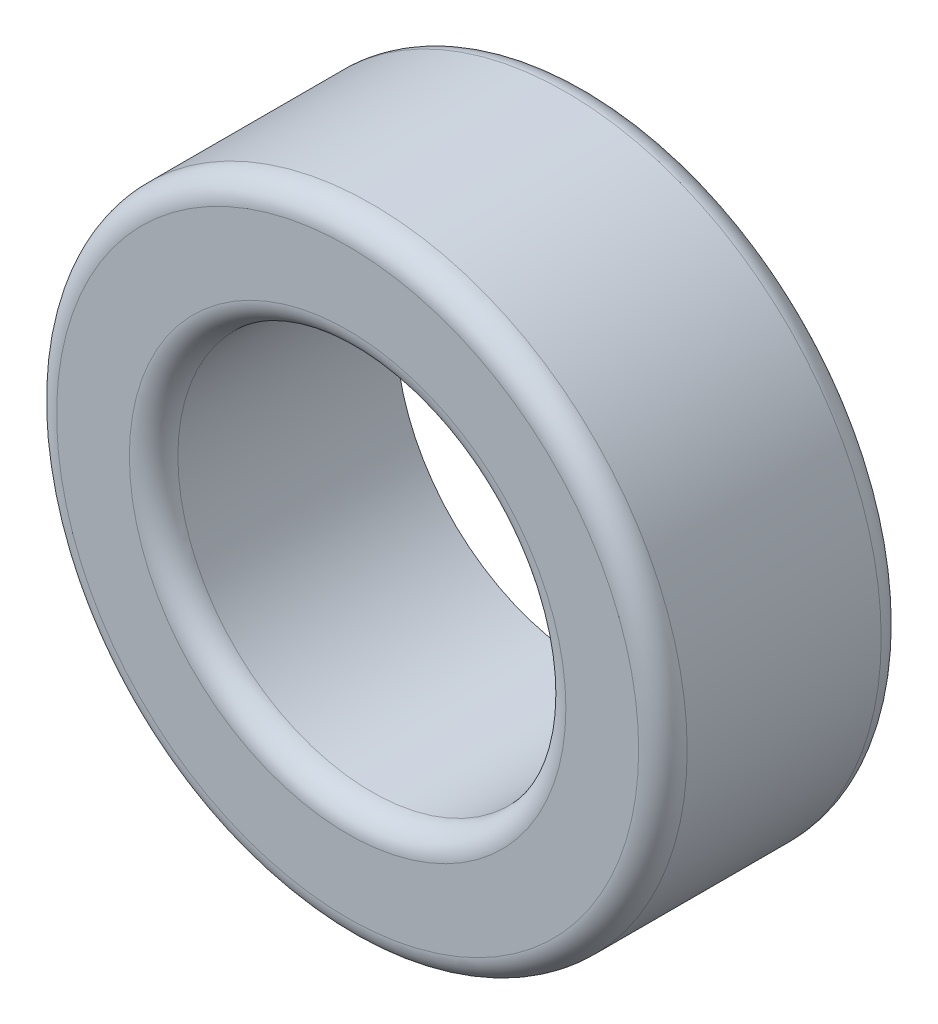
ISO-10303-21;
HEADER;
FILE_DESCRIPTION(('STEP AP214'),'2;1');
FILE_NAME('part.step','',(''),(''),'','','');
FILE_SCHEMA(('AUTOMOTIVE_DESIGN { 1 0 10303 214 1 1 1 1 }'));
ENDSEC;
DATA;
#1=APPLICATION_CONTEXT('core data for automotive mechanical design processes');
#2=APPLICATION_PROTOCOL_DEFINITION('international standard','automotive_design',2000,#1);
#3=PRODUCT_CONTEXT('',#1,'mechanical');
#4=PRODUCT('Part','Part','',(#3));
#5=PRODUCT_RELATED_PRODUCT_CATEGORY('part','',(#4));
#6=PRODUCT_DEFINITION_FORMATION('','',#4);
#7=PRODUCT_DEFINITION_CONTEXT('part definition',#1,'design');
#8=PRODUCT_DEFINITION('design','',#6,#7);
#9=PRODUCT_DEFINITION_SHAPE('','',#8);
#10=(LENGTH_UNIT() NAMED_UNIT(*) SI_UNIT(.MILLI.,.METRE.));
#11=(NAMED_UNIT(*) PLANE_ANGLE_UNIT() SI_UNIT($,.RADIAN.));
#12=(NAMED_UNIT(*) SI_UNIT($,.STERADIAN.) SOLID_ANGLE_UNIT());
#13=UNCERTAINTY_MEASURE_WITH_UNIT(LENGTH_MEASURE(1.E-05),#10,'distance_accuracy_value','');
#14=(GEOMETRIC_REPRESENTATION_CONTEXT(3) GLOBAL_UNCERTAINTY_ASSIGNED_CONTEXT((#13)) GLOBAL_UNIT_ASSIGNED_CONTEXT((#10,
#11,#12)) REPRESENTATION_CONTEXT('',''));
#15=CARTESIAN_POINT('',(0.,0.,0.));
#16=DIRECTION('',(0.,0.,1.));
#17=DIRECTION('',(1.,0.,0.));
#18=AXIS2_PLACEMENT_3D('',#15,#16,#17);
#19=CARTESIAN_POINT('',(0.,0.,5.));
#20=DIRECTION('',(0.,0.,1.));
#21=DIRECTION('',(1.,0.,0.));
#22=AXIS2_PLACEMENT_3D('',#19,#20,#21);
#23=PLANE('',#22);
#24=CARTESIAN_POINT('',(0.,0.,5.));
#25=DIRECTION('',(0.,0.,1.));
#26=DIRECTION('',(1.,0.,0.));
#27=AXIS2_PLACEMENT_3D('',#24,#25,#26);
#28=CIRCLE('',#27,4.5);
#29=CARTESIAN_POINT('',(4.5,0.,5.));
#30=VERTEX_POINT('',#29);
#31=EDGE_CURVE('E56',#30,#30,#28,.F.);
#32=ORIENTED_EDGE('',*,*,#31,.T.);
#33=EDGE_LOOP('',(#32));
#34=FACE_BOUND('',#33,.T.);
#35=CARTESIAN_POINT('',(0.,0.,5.));
#36=DIRECTION('',(0.,0.,1.));
#37=DIRECTION('',(1.,0.,0.));
#38=AXIS2_PLACEMENT_3D('',#35,#36,#37);
#39=CIRCLE('',#38,6.);
#40=CARTESIAN_POINT('',(6.,0.,5.));
#41=VERTEX_POINT('',#40);
#42=EDGE_CURVE('E62',#41,#41,#39,.T.);
#43=ORIENTED_EDGE('',*,*,#42,.T.);
#44=EDGE_LOOP('',(#43));
#45=FACE_BOUND('',#44,.T.);
#46=ADVANCED_FACE('F38',(#34,#45),#23,.T.);
#47=CARTESIAN_POINT('',(0.,0.,0.));
#48=DIRECTION('',(0.,0.,1.));
#49=DIRECTION('',(1.,0.,0.));
#50=AXIS2_PLACEMENT_3D('',#47,#48,#49);
#51=PLANE('',#50);
#52=CARTESIAN_POINT('',(0.,0.,0.));
#53=DIRECTION('',(0.,0.,1.));
#54=DIRECTION('',(1.,0.,0.));
#55=AXIS2_PLACEMENT_3D('',#52,#53,#54);
#56=CIRCLE('',#55,6.);
#57=CARTESIAN_POINT('',(6.,0.,0.));
#58=VERTEX_POINT('',#57);
#59=EDGE_CURVE('E10',#58,#58,#56,.F.);
#60=ORIENTED_EDGE('',*,*,#59,.T.);
#61=EDGE_LOOP('',(#60));
#62=FACE_BOUND('',#61,.T.);
#63=CARTESIAN_POINT('',(0.,0.,0.));
#64=DIRECTION('',(0.,0.,1.));
#65=DIRECTION('',(1.,0.,0.));
#66=AXIS2_PLACEMENT_3D('',#63,#64,#65);
#67=CIRCLE('',#66,4.);
#68=CARTESIAN_POINT('',(4.,0.,0.));
#69=VERTEX_POINT('',#68);
#70=EDGE_CURVE('E70',#69,#69,#67,.T.);
#71=ORIENTED_EDGE('',*,*,#70,.T.);
#72=EDGE_LOOP('',(#71));
#73=FACE_BOUND('',#72,.T.);
#74=ADVANCED_FACE('F75',(#62,#73),#51,.F.);
#75=CARTESIAN_POINT('',(0.,0.,5.));
#76=DIRECTION('',(0.,0.,-1.));
#77=DIRECTION('',(-1.,0.,0.));
#78=AXIS2_PLACEMENT_3D('',#75,#76,#77);
#79=CYLINDRICAL_SURFACE('',#78,6.5);
#80=CARTESIAN_POINT('',(0.,0.,4.5));
#81=DIRECTION('',(0.,0.,1.));
#82=DIRECTION('',(1.,0.,0.));
#83=AXIS2_PLACEMENT_3D('',#80,#81,#82);
#84=CIRCLE('',#83,6.5);
#85=CARTESIAN_POINT('',(6.5,0.,4.5));
#86=VERTEX_POINT('',#85);
#87=EDGE_CURVE('E46',#86,#86,#84,.F.);
#88=ORIENTED_EDGE('',*,*,#87,.T.);
#89=EDGE_LOOP('',(#88));
#90=FACE_BOUND('',#89,.T.);
#91=CARTESIAN_POINT('',(0.,0.,0.5));
#92=DIRECTION('',(0.,0.,1.));
#93=DIRECTION('',(1.,0.,0.));
#94=AXIS2_PLACEMENT_3D('',#91,#92,#93);
#95=CIRCLE('',#94,6.5);
#96=CARTESIAN_POINT('',(6.5,0.,0.5));
#97=VERTEX_POINT('',#96);
#98=EDGE_CURVE('E51',#97,#97,#95,.T.);
#99=ORIENTED_EDGE('',*,*,#98,.T.);
#100=EDGE_LOOP('',(#99));
#101=FACE_BOUND('',#100,.T.);
#102=ADVANCED_FACE('F80',(#90,#101),#79,.T.);
#103=CARTESIAN_POINT('',(0.,0.,5.));
#104=DIRECTION('',(0.,0.,-1.));
#105=DIRECTION('',(-1.,0.,0.));
#106=AXIS2_PLACEMENT_3D('',#103,#104,#105);
#107=CYLINDRICAL_SURFACE('',#106,4.);
#108=CARTESIAN_POINT('',(0.,0.,4.5));
#109=DIRECTION('',(0.,0.,1.));
#110=DIRECTION('',(1.,0.,0.));
#111=AXIS2_PLACEMENT_3D('',#108,#109,#110);
#112=CIRCLE('',#111,4.);
#113=CARTESIAN_POINT('',(4.,0.,4.5));
#114=VERTEX_POINT('',#113);
#115=EDGE_CURVE('E66',#114,#114,#112,.T.);
#116=ORIENTED_EDGE('',*,*,#115,.T.);
#117=EDGE_LOOP('',(#116));
#118=FACE_BOUND('',#117,.T.);
#119=ORIENTED_EDGE('',*,*,#70,.F.);
#120=EDGE_LOOP('',(#119));
#121=FACE_BOUND('',#120,.T.);
#122=ADVANCED_FACE('F77',(#118,#121),#107,.F.);
#123=CARTESIAN_POINT('',(0.,0.,4.5));
#124=DIRECTION('',(0.,0.,1.));
#125=DIRECTION('',(1.,0.,0.));
#126=AXIS2_PLACEMENT_3D('',#123,#124,#125);
#127=TOROIDAL_SURFACE('',#126,4.5,0.5);
#128=ORIENTED_EDGE('',*,*,#31,.F.);
#129=EDGE_LOOP('',(#128));
#130=FACE_BOUND('',#129,.T.);
#131=ORIENTED_EDGE('',*,*,#115,.F.);
#132=EDGE_LOOP('',(#131));
#133=FACE_BOUND('',#132,.T.);
#134=ADVANCED_FACE('F79',(#130,#133),#127,.T.);
#135=CARTESIAN_POINT('',(0.,0.,4.5));
#136=DIRECTION('',(0.,0.,1.));
#137=DIRECTION('',(1.,0.,0.));
#138=AXIS2_PLACEMENT_3D('',#135,#136,#137);
#139=TOROIDAL_SURFACE('',#138,6.,0.5);
#140=ORIENTED_EDGE('',*,*,#87,.F.);
#141=EDGE_LOOP('',(#140));
#142=FACE_BOUND('',#141,.T.);
#143=ORIENTED_EDGE('',*,*,#42,.F.);
#144=EDGE_LOOP('',(#143));
#145=FACE_BOUND('',#144,.T.);
#146=ADVANCED_FACE('F88',(#142,#145),#139,.T.);
#147=CARTESIAN_POINT('',(0.,0.,0.5));
#148=DIRECTION('',(0.,0.,1.));
#149=DIRECTION('',(1.,0.,0.));
#150=AXIS2_PLACEMENT_3D('',#147,#148,#149);
#151=TOROIDAL_SURFACE('',#150,6.,0.5);
#152=ORIENTED_EDGE('',*,*,#59,.F.);
#153=EDGE_LOOP('',(#152));
#154=FACE_BOUND('',#153,.T.);
#155=ORIENTED_EDGE('',*,*,#98,.F.);
#156=EDGE_LOOP('',(#155));
#157=FACE_BOUND('',#156,.T.);
#158=ADVANCED_FACE('F40',(#154,#157),#151,.T.);
#159=CLOSED_SHELL('',(#46,#74,#102,#122,#134,#146,#158));
#160=MANIFOLD_SOLID_BREP('B2',#159);
#161=ADVANCED_BREP_SHAPE_REPRESENTATION('',(#18,#160),#14);
#162=SHAPE_DEFINITION_REPRESENTATION(#9,#161);
ENDSEC;
END-ISO-10303-21;
